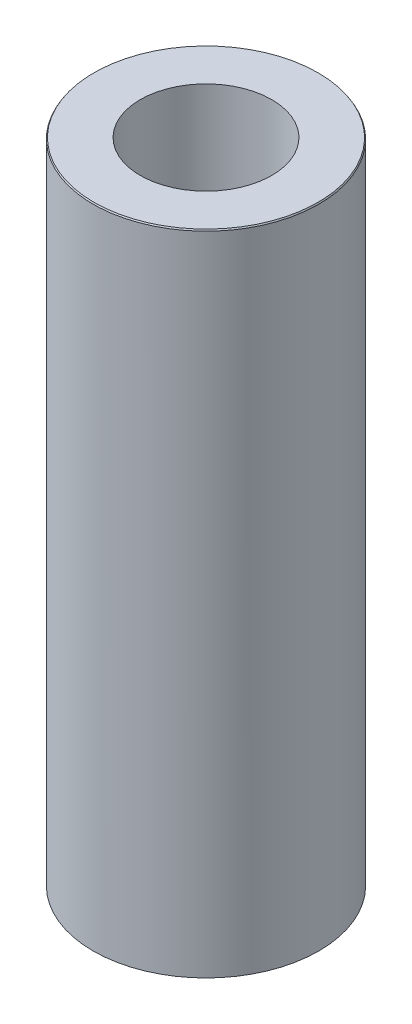
ISO-10303-21;
HEADER;
FILE_DESCRIPTION(('STEP AP214'),'2;1');
FILE_NAME('part.step','',(''),(''),'','','');
FILE_SCHEMA(('AUTOMOTIVE_DESIGN { 1 0 10303 214 1 1 1 1 }'));
ENDSEC;
DATA;
#1=APPLICATION_CONTEXT('core data for automotive mechanical design processes');
#2=APPLICATION_PROTOCOL_DEFINITION('international standard','automotive_design',2000,#1);
#3=PRODUCT_CONTEXT('',#1,'mechanical');
#4=PRODUCT('Part','Part','',(#3));
#5=PRODUCT_RELATED_PRODUCT_CATEGORY('part','',(#4));
#6=PRODUCT_DEFINITION_FORMATION('','',#4);
#7=PRODUCT_DEFINITION_CONTEXT('part definition',#1,'design');
#8=PRODUCT_DEFINITION('design','',#6,#7);
#9=PRODUCT_DEFINITION_SHAPE('','',#8);
#10=(LENGTH_UNIT() NAMED_UNIT(*) SI_UNIT(.MILLI.,.METRE.));
#11=(NAMED_UNIT(*) PLANE_ANGLE_UNIT() SI_UNIT($,.RADIAN.));
#12=(NAMED_UNIT(*) SI_UNIT($,.STERADIAN.) SOLID_ANGLE_UNIT());
#13=UNCERTAINTY_MEASURE_WITH_UNIT(LENGTH_MEASURE(1.E-05),#10,'distance_accuracy_value','');
#14=(GEOMETRIC_REPRESENTATION_CONTEXT(3) GLOBAL_UNCERTAINTY_ASSIGNED_CONTEXT((#13)) GLOBAL_UNIT_ASSIGNED_CONTEXT((#10,
#11,#12)) REPRESENTATION_CONTEXT('',''));
#15=CARTESIAN_POINT('',(0.,0.,0.));
#16=DIRECTION('',(0.,0.,1.));
#17=DIRECTION('',(1.,0.,0.));
#18=AXIS2_PLACEMENT_3D('',#15,#16,#17);
#19=CARTESIAN_POINT('',(0.,244.245501333394,0.));
#20=DIRECTION('',(0.,-1.,0.));
#21=DIRECTION('',(0.,0.,-1.));
#22=AXIS2_PLACEMENT_3D('',#19,#20,#21);
#23=CYLINDRICAL_SURFACE('',#22,42.5);
#24=CARTESIAN_POINT('',(0.,243.756246926191,0.));
#25=DIRECTION('',(0.,1.,0.));
#26=DIRECTION('',(0.,0.,1.));
#27=AXIS2_PLACEMENT_3D('',#24,#25,#26);
#28=CIRCLE('',#27,42.5);
#29=CARTESIAN_POINT('',(0.,243.756246926191,-42.5));
#30=VERTEX_POINT('',#29);
#31=EDGE_CURVE('E50',#30,#30,#28,.F.);
#32=CARTESIAN_POINT('',(0.,0.282471163701059,0.));
#33=DIRECTION('',(0.,1.,0.));
#34=DIRECTION('',(0.,0.,1.));
#35=AXIS2_PLACEMENT_3D('',#32,#33,#34);
#36=CIRCLE('',#35,42.5);
#37=CARTESIAN_POINT('',(0.,0.282471163701059,-42.5));
#38=VERTEX_POINT('',#37);
#39=EDGE_CURVE('E51',#38,#38,#36,.T.);
#40=CARTESIAN_POINT('',(0.,243.756246926191,-42.5));
#41=CARTESIAN_POINT('',(0.,241.220061761999,-42.5));
#42=CARTESIAN_POINT('',(0.,238.683876597806,-42.5));
#43=CARTESIAN_POINT('',(0.,233.611506269421,-42.5));
#44=CARTESIAN_POINT('',(0.,231.075321105228,-42.5));
#45=CARTESIAN_POINT('',(0.,226.002950776843,-42.5));
#46=CARTESIAN_POINT('',(0.,223.46676561265,-42.5));
#47=CARTESIAN_POINT('',(0.,218.394395284265,-42.5));
#48=CARTESIAN_POINT('',(0.,215.858210120073,-42.5));
#49=CARTESIAN_POINT('',(0.,210.785839791687,-42.5));
#50=CARTESIAN_POINT('',(0.,208.249654627495,-42.5));
#51=CARTESIAN_POINT('',(0.,203.17728429911,-42.5));
#52=CARTESIAN_POINT('',(0.,200.641099134917,-42.5));
#53=CARTESIAN_POINT('',(0.,195.568728806532,-42.5));
#54=CARTESIAN_POINT('',(0.,193.032543642339,-42.5));
#55=CARTESIAN_POINT('',(0.,187.960173313954,-42.5));
#56=CARTESIAN_POINT('',(0.,185.423988149761,-42.5));
#57=CARTESIAN_POINT('',(0.,180.351617821376,-42.5));
#58=CARTESIAN_POINT('',(0.,177.815432657184,-42.5));
#59=CARTESIAN_POINT('',(0.,172.743062328798,-42.5));
#60=CARTESIAN_POINT('',(0.,170.206877164606,-42.5));
#61=CARTESIAN_POINT('',(0.,165.134506836221,-42.5));
#62=CARTESIAN_POINT('',(0.,162.598321672028,-42.5));
#63=CARTESIAN_POINT('',(0.,157.525951343643,-42.5));
#64=CARTESIAN_POINT('',(0.,154.98976617945,-42.5));
#65=CARTESIAN_POINT('',(0.,149.917395851065,-42.5));
#66=CARTESIAN_POINT('',(0.,147.381210686872,-42.5));
#67=CARTESIAN_POINT('',(0.,142.308840358487,-42.5));
#68=CARTESIAN_POINT('',(0.,139.772655194294,-42.5));
#69=CARTESIAN_POINT('',(0.,134.700284865909,-42.5));
#70=CARTESIAN_POINT('',(0.,132.164099701717,-42.5));
#71=CARTESIAN_POINT('',(0.,127.091729373331,-42.5));
#72=CARTESIAN_POINT('',(0.,124.555544209139,-42.5));
#73=CARTESIAN_POINT('',(0.,119.483173880754,-42.5));
#74=CARTESIAN_POINT('',(0.,116.946988716561,-42.5));
#75=CARTESIAN_POINT('',(0.,111.874618388176,-42.5));
#76=CARTESIAN_POINT('',(0.,109.338433223983,-42.5));
#77=CARTESIAN_POINT('',(0.,104.266062895598,-42.5));
#78=CARTESIAN_POINT('',(0.,101.729877731405,-42.5));
#79=CARTESIAN_POINT('',(0.,96.6575074030201,-42.5));
#80=CARTESIAN_POINT('',(0.,94.1213222388275,-42.5));
#81=CARTESIAN_POINT('',(0.,89.0489519104423,-42.5));
#82=CARTESIAN_POINT('',(0.,86.5127667462497,-42.5));
#83=CARTESIAN_POINT('',(0.,81.4403964178645,-42.5));
#84=CARTESIAN_POINT('',(0.,78.9042112536719,-42.5));
#85=CARTESIAN_POINT('',(0.,73.8318409252866,-42.5));
#86=CARTESIAN_POINT('',(0.,71.2956557610941,-42.5));
#87=CARTESIAN_POINT('',(0.,66.2232854327088,-42.5));
#88=CARTESIAN_POINT('',(0.,63.6871002685162,-42.5));
#89=CARTESIAN_POINT('',(0.,58.614729940131,-42.5));
#90=CARTESIAN_POINT('',(0.,56.0785447759384,-42.5));
#91=CARTESIAN_POINT('',(0.,51.0061744475532,-42.5));
#92=CARTESIAN_POINT('',(0.,48.4699892833606,-42.5));
#93=CARTESIAN_POINT('',(0.,43.3976189549754,-42.5));
#94=CARTESIAN_POINT('',(0.,40.8614337907828,-42.5));
#95=CARTESIAN_POINT('',(0.,35.7890634623976,-42.5));
#96=CARTESIAN_POINT('',(0.,33.2528782982049,-42.5));
#97=CARTESIAN_POINT('',(0.,28.1805079698197,-42.5));
#98=CARTESIAN_POINT('',(0.,25.6443228056271,-42.5));
#99=CARTESIAN_POINT('',(0.,20.5719524772419,-42.5));
#100=CARTESIAN_POINT('',(0.,18.0357673130493,-42.5));
#101=CARTESIAN_POINT('',(0.,12.9633969846641,-42.5));
#102=CARTESIAN_POINT('',(0.,10.4272118204715,-42.5));
#103=CARTESIAN_POINT('',(0.,5.35484149208628,-42.5));
#104=CARTESIAN_POINT('',(0.,2.81865632789367,-42.5));
#105=CARTESIAN_POINT('',(0.,0.282471163701059,-42.5));
#106=B_SPLINE_CURVE_WITH_KNOTS('',3,(#40,#41,#42,#43,#44,#45,#46,#47,#48,#49,#50,#51,#52,#53,
#54,#55,#56,#57,#58,#59,#60,#61,#62,#63,#64,#65,#66,#67,#68,#69,#70,#71,#72,#73,#74,#75,#76,#77,
#78,#79,#80,#81,#82,#83,#84,#85,#86,#87,#88,#89,#90,#91,#92,#93,#94,#95,#96,#97,#98,#99,#100,
#101,#102,#103,#104,#105),.UNSPECIFIED.,.F.,.F.,(4,2,2,2,2,2,2,2,2,2,2,2,2,2,2,2,2,2,2,2,2,2,2,
2,2,2,2,2,2,2,2,2,4),(0.,7.6085554925778,15.2171109851556,22.8256664777334,30.4342219703113,
38.0427774628891,45.6513329554669,53.2598884480447,60.8684439406225,68.4769994332003,
76.0855549257782,83.694110418356,91.3026659109338,98.9112214035116,106.519776896089,
114.128332388667,121.736887881245,129.345443373823,136.953998866401,144.562554358979,
152.171109851556,159.779665344134,167.388220836712,174.99677632929,182.605331821868,
190.213887314445,197.822442807023,205.430998299601,213.039553792179,220.648109284757,
228.256664777335,235.865220269912,243.47377576249),.UNSPECIFIED.);
#107=EDGE_CURVE('BSEAM39',#30,#38,#106,.T.);
#108=ORIENTED_EDGE('',*,*,#31,.T.);
#109=ORIENTED_EDGE('',*,*,#39,.T.);
#110=ORIENTED_EDGE('',*,*,#107,.T.);
#111=ORIENTED_EDGE('',*,*,#107,.F.);
#112=EDGE_LOOP('',(#108,#110,#109,#111));
#113=FACE_BOUND('',#112,.T.);
#114=ADVANCED_FACE('F39',(#113),#23,.T.);
#115=CARTESIAN_POINT('',(0.,244.245501333394,0.));
#116=DIRECTION('',(0.,1.,0.));
#117=DIRECTION('',(0.,0.,1.));
#118=AXIS2_PLACEMENT_3D('',#115,#116,#117);
#119=PLANE('',#118);
#120=CARTESIAN_POINT('',(0.,244.245501333394,0.));
#121=DIRECTION('',(0.,1.,0.));
#122=DIRECTION('',(0.,0.,1.));
#123=AXIS2_PLACEMENT_3D('',#120,#121,#122);
#124=CIRCLE('',#123,42.2175288362991);
#125=CARTESIAN_POINT('',(0.,244.245501333394,42.2175288362991));
#126=VERTEX_POINT('',#125);
#127=EDGE_CURVE('E54',#126,#126,#124,.T.);
#128=ORIENTED_EDGE('',*,*,#127,.T.);
#129=EDGE_LOOP('',(#128));
#130=FACE_BOUND('',#129,.T.);
#131=CARTESIAN_POINT('',(0.,244.245501333394,0.));
#132=DIRECTION('',(0.,1.,0.));
#133=DIRECTION('',(0.,0.,1.));
#134=AXIS2_PLACEMENT_3D('',#131,#132,#133);
#135=CIRCLE('',#134,24.7524285840663);
#136=CARTESIAN_POINT('',(0.,244.245501333394,-24.7524285840663));
#137=VERTEX_POINT('',#136);
#138=EDGE_CURVE('E58',#137,#137,#135,.T.);
#139=ORIENTED_EDGE('',*,*,#138,.F.);
#140=EDGE_LOOP('',(#139));
#141=FACE_BOUND('',#140,.T.);
#142=ADVANCED_FACE('F69',(#130,#141),#119,.T.);
#143=CARTESIAN_POINT('',(0.,0.,0.));
#144=DIRECTION('',(0.,1.,0.));
#145=DIRECTION('',(0.,0.,1.));
#146=AXIS2_PLACEMENT_3D('',#143,#144,#145);
#147=PLANE('',#146);
#148=CARTESIAN_POINT('',(0.,0.,0.));
#149=DIRECTION('',(0.,1.,0.));
#150=DIRECTION('',(0.,0.,1.));
#151=AXIS2_PLACEMENT_3D('',#148,#149,#150);
#152=CIRCLE('',#151,42.0107455927967);
#153=CARTESIAN_POINT('',(0.,0.,42.0107455927967));
#154=VERTEX_POINT('',#153);
#155=EDGE_CURVE('E10',#154,#154,#152,.F.);
#156=ORIENTED_EDGE('',*,*,#155,.T.);
#157=EDGE_LOOP('',(#156));
#158=FACE_BOUND('',#157,.T.);
#159=CARTESIAN_POINT('',(0.,0.,0.));
#160=DIRECTION('',(0.,1.,0.));
#161=DIRECTION('',(0.,0.,1.));
#162=AXIS2_PLACEMENT_3D('',#159,#160,#161);
#163=CIRCLE('',#162,24.7524285840663);
#164=CARTESIAN_POINT('',(0.,0.,-24.7524285840663));
#165=VERTEX_POINT('',#164);
#166=EDGE_CURVE('E63',#165,#165,#163,.T.);
#167=ORIENTED_EDGE('',*,*,#166,.T.);
#168=EDGE_LOOP('',(#167));
#169=FACE_BOUND('',#168,.T.);
#170=ADVANCED_FACE('F75',(#158,#169),#147,.F.);
#171=CARTESIAN_POINT('',(0.,244.245501333394,0.));
#172=DIRECTION('',(0.,-1.,0.));
#173=DIRECTION('',(0.,0.,-1.));
#174=AXIS2_PLACEMENT_3D('',#171,#172,#173);
#175=CYLINDRICAL_SURFACE('',#174,24.7524285840663);
#176=CARTESIAN_POINT('',(0.,244.245501333394,-24.7524285840663));
#177=CARTESIAN_POINT('',(0.,241.701277361171,-24.7524285840663));
#178=CARTESIAN_POINT('',(0.,239.157053388949,-24.7524285840663));
#179=CARTESIAN_POINT('',(0.,234.068605444503,-24.7524285840663));
#180=CARTESIAN_POINT('',(0.,231.52438147228,-24.7524285840663));
#181=CARTESIAN_POINT('',(0.,226.435933527834,-24.7524285840663));
#182=CARTESIAN_POINT('',(0.,223.891709555611,-24.7524285840663));
#183=CARTESIAN_POINT('',(0.,218.803261611166,-24.7524285840663));
#184=CARTESIAN_POINT('',(0.,216.259037638943,-24.7524285840663));
#185=CARTESIAN_POINT('',(0.,211.170589694497,-24.7524285840663));
#186=CARTESIAN_POINT('',(0.,208.626365722274,-24.7524285840663));
#187=CARTESIAN_POINT('',(0.,203.537917777829,-24.7524285840663));
#188=CARTESIAN_POINT('',(0.,200.993693805606,-24.7524285840663));
#189=CARTESIAN_POINT('',(0.,195.90524586116,-24.7524285840663));
#190=CARTESIAN_POINT('',(0.,193.361021888937,-24.7524285840663));
#191=CARTESIAN_POINT('',(0.,188.272573944491,-24.7524285840663));
#192=CARTESIAN_POINT('',(0.,185.728349972269,-24.7524285840663));
#193=CARTESIAN_POINT('',(0.,180.639902027823,-24.7524285840663));
#194=CARTESIAN_POINT('',(0.,178.0956780556,-24.7524285840663));
#195=CARTESIAN_POINT('',(0.,173.007230111154,-24.7524285840663));
#196=CARTESIAN_POINT('',(0.,170.463006138931,-24.7524285840663));
#197=CARTESIAN_POINT('',(0.,165.374558194486,-24.7524285840663));
#198=CARTESIAN_POINT('',(0.,162.830334222263,-24.7524285840663));
#199=CARTESIAN_POINT('',(0.,157.741886277817,-24.7524285840663));
#200=CARTESIAN_POINT('',(0.,155.197662305594,-24.7524285840663));
#201=CARTESIAN_POINT('',(0.,150.109214361149,-24.7524285840663));
#202=CARTESIAN_POINT('',(0.,147.564990388926,-24.7524285840663));
#203=CARTESIAN_POINT('',(0.,142.47654244448,-24.7524285840663));
#204=CARTESIAN_POINT('',(0.,139.932318472257,-24.7524285840663));
#205=CARTESIAN_POINT('',(0.,134.843870527811,-24.7524285840663));
#206=CARTESIAN_POINT('',(0.,132.299646555589,-24.7524285840663));
#207=CARTESIAN_POINT('',(0.,127.211198611143,-24.7524285840663));
#208=CARTESIAN_POINT('',(0.,124.66697463892,-24.7524285840663));
#209=CARTESIAN_POINT('',(0.,119.578526694474,-24.7524285840663));
#210=CARTESIAN_POINT('',(0.,117.034302722251,-24.7524285840663));
#211=CARTESIAN_POINT('',(0.,111.945854777806,-24.7524285840663));
#212=CARTESIAN_POINT('',(0.,109.401630805583,-24.7524285840663));
#213=CARTESIAN_POINT('',(0.,104.313182861137,-24.7524285840663));
#214=CARTESIAN_POINT('',(0.,101.768958888914,-24.7524285840663));
#215=CARTESIAN_POINT('',(0.,96.6805109444686,-24.7524285840663));
#216=CARTESIAN_POINT('',(0.,94.1362869722457,-24.7524285840663));
#217=CARTESIAN_POINT('',(0.,89.0478390278,-24.7524285840663));
#218=CARTESIAN_POINT('',(0.,86.5036150555771,-24.7524285840663));
#219=CARTESIAN_POINT('',(0.,81.4151671111314,-24.7524285840663));
#220=CARTESIAN_POINT('',(0.,78.8709431389086,-24.7524285840663));
#221=CARTESIAN_POINT('',(0.,73.7824951944629,-24.7524285840663));
#222=CARTESIAN_POINT('',(0.,71.23827122224,-24.7524285840663));
#223=CARTESIAN_POINT('',(0.,66.1498232777943,-24.7524285840663));
#224=CARTESIAN_POINT('',(0.,63.6055993055714,-24.7524285840663));
#225=CARTESIAN_POINT('',(0.,58.5171513611257,-24.7524285840663));
#226=CARTESIAN_POINT('',(0.,55.9729273889029,-24.7524285840663));
#227=CARTESIAN_POINT('',(0.,50.8844794444572,-24.7524285840663));
#228=CARTESIAN_POINT('',(0.,48.3402554722343,-24.7524285840663));
#229=CARTESIAN_POINT('',(0.,43.2518075277886,-24.7524285840663));
#230=CARTESIAN_POINT('',(0.,40.7075835555657,-24.7524285840663));
#231=CARTESIAN_POINT('',(0.,35.61913561112,-24.7524285840663));
#232=CARTESIAN_POINT('',(0.,33.0749116388971,-24.7524285840663));
#233=CARTESIAN_POINT('',(0.,27.9864636944514,-24.7524285840663));
#234=CARTESIAN_POINT('',(0.,25.4422397222286,-24.7524285840663));
#235=CARTESIAN_POINT('',(0.,20.3537917777829,-24.7524285840663));
#236=CARTESIAN_POINT('',(0.,17.80956780556,-24.7524285840663));
#237=CARTESIAN_POINT('',(0.,12.7211198611143,-24.7524285840663));
#238=CARTESIAN_POINT('',(0.,10.1768958888914,-24.7524285840663));
#239=CARTESIAN_POINT('',(0.,5.08844794444572,-24.7524285840663));
#240=CARTESIAN_POINT('',(0.,2.54422397222286,-24.7524285840663));
#241=CARTESIAN_POINT('',(0.,0.,-24.7524285840663));
#242=B_SPLINE_CURVE_WITH_KNOTS('',3,(#176,#177,#178,#179,#180,#181,#182,#183,#184,#185,#186,
#187,#188,#189,#190,#191,#192,#193,#194,#195,#196,#197,#198,#199,#200,#201,#202,#203,#204,#205,
#206,#207,#208,#209,#210,#211,#212,#213,#214,#215,#216,#217,#218,#219,#220,#221,#222,#223,#224,
#225,#226,#227,#228,#229,#230,#231,#232,#233,#234,#235,#236,#237,#238,#239,#240,#241),
.UNSPECIFIED.,.F.,.F.,(4,2,2,2,2,2,2,2,2,2,2,2,2,2,2,2,2,2,2,2,2,2,2,2,2,2,2,2,2,2,2,2,4),(0.,
7.63267191666855,15.2653438333371,22.8980157500057,30.5306876666743,38.1633595833428,
45.7960315000114,53.42870341668,61.0613753333485,68.6940472500171,76.3267191666857,
83.9593910833543,91.5920630000228,99.2247349166914,106.85740683336,114.490078750029,
122.122750666697,129.755422583366,137.388094500034,145.020766416703,152.653438333371,
160.28611025004,167.918782166709,175.551454083377,183.184126000046,190.816797916714,
198.449469833383,206.082141750051,213.71481366672,221.347485583389,228.980157500057,
236.612829416726,244.245501333394),.UNSPECIFIED.);
#243=EDGE_CURVE('BSEAM70',#137,#165,#242,.T.);
#244=ORIENTED_EDGE('',*,*,#138,.T.);
#245=ORIENTED_EDGE('',*,*,#166,.F.);
#246=ORIENTED_EDGE('',*,*,#243,.T.);
#247=ORIENTED_EDGE('',*,*,#243,.F.);
#248=EDGE_LOOP('',(#244,#246,#245,#247));
#249=FACE_BOUND('',#248,.T.);
#250=ADVANCED_FACE('F70',(#249),#175,.F.);
#251=CARTESIAN_POINT('',(0.,244.245501333394,0.));
#252=DIRECTION('',(0.,-1.,0.));
#253=DIRECTION('',(0.,0.,-1.));
#254=AXIS2_PLACEMENT_3D('',#251,#252,#253);
#255=CONICAL_SURFACE('',#254,42.2175288362991,0.523598775598288);
#256=ORIENTED_EDGE('',*,*,#31,.F.);
#257=EDGE_LOOP('',(#256));
#258=FACE_BOUND('',#257,.T.);
#259=ORIENTED_EDGE('',*,*,#127,.F.);
#260=EDGE_LOOP('',(#259));
#261=FACE_BOUND('',#260,.T.);
#262=ADVANCED_FACE('F81',(#258,#261),#255,.T.);
#263=CARTESIAN_POINT('',(0.,0.282471163701059,0.));
#264=DIRECTION('',(0.,1.,0.));
#265=DIRECTION('',(0.,0.,1.));
#266=AXIS2_PLACEMENT_3D('',#263,#264,#265);
#267=CONICAL_SURFACE('',#266,42.5,1.04719755119659);
#268=ORIENTED_EDGE('',*,*,#155,.F.);
#269=EDGE_LOOP('',(#268));
#270=FACE_BOUND('',#269,.T.);
#271=ORIENTED_EDGE('',*,*,#39,.F.);
#272=EDGE_LOOP('',(#271));
#273=FACE_BOUND('',#272,.T.);
#274=ADVANCED_FACE('F45',(#270,#273),#267,.T.);
#275=CLOSED_SHELL('',(#114,#142,#170,#250,#262,#274));
#276=MANIFOLD_SOLID_BREP('B2',#275);
#277=ADVANCED_BREP_SHAPE_REPRESENTATION('',(#18,#276),#14);
#278=SHAPE_DEFINITION_REPRESENTATION(#9,#277);
ENDSEC;
END-ISO-10303-21;
